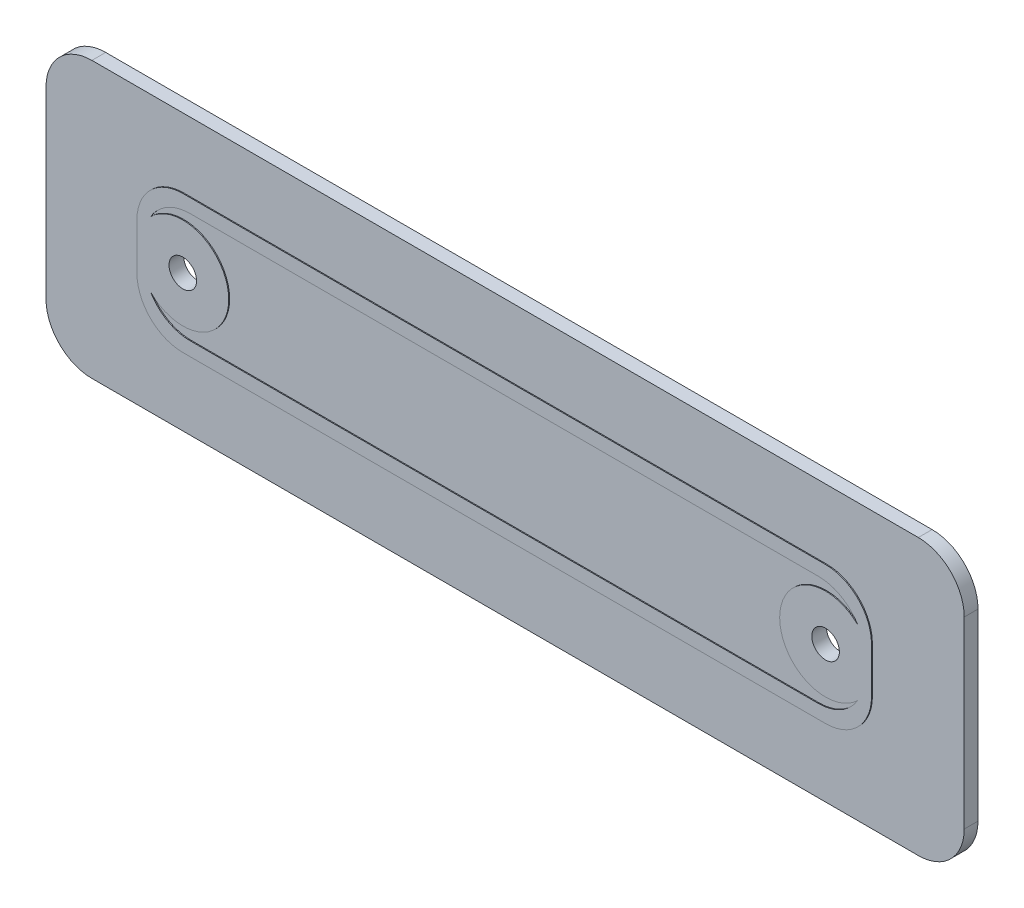
ISO-10303-21;
HEADER;
FILE_DESCRIPTION(('STEP AP214'),'2;1');
FILE_NAME('part.step','',(''),(''),'','','');
FILE_SCHEMA(('AUTOMOTIVE_DESIGN { 1 0 10303 214 1 1 1 1 }'));
ENDSEC;
DATA;
#1=APPLICATION_CONTEXT('core data for automotive mechanical design processes');
#2=APPLICATION_PROTOCOL_DEFINITION('international standard','automotive_design',2000,#1);
#3=PRODUCT_CONTEXT('',#1,'mechanical');
#4=PRODUCT('Part','Part','',(#3));
#5=PRODUCT_RELATED_PRODUCT_CATEGORY('part','',(#4));
#6=PRODUCT_DEFINITION_FORMATION('','',#4);
#7=PRODUCT_DEFINITION_CONTEXT('part definition',#1,'design');
#8=PRODUCT_DEFINITION('design','',#6,#7);
#9=PRODUCT_DEFINITION_SHAPE('','',#8);
#10=(LENGTH_UNIT() NAMED_UNIT(*) SI_UNIT(.MILLI.,.METRE.));
#11=(NAMED_UNIT(*) PLANE_ANGLE_UNIT() SI_UNIT($,.RADIAN.));
#12=(NAMED_UNIT(*) SI_UNIT($,.STERADIAN.) SOLID_ANGLE_UNIT());
#13=UNCERTAINTY_MEASURE_WITH_UNIT(LENGTH_MEASURE(1.E-05),#10,'distance_accuracy_value','');
#14=(GEOMETRIC_REPRESENTATION_CONTEXT(3) GLOBAL_UNCERTAINTY_ASSIGNED_CONTEXT((#13)) GLOBAL_UNIT_ASSIGNED_CONTEXT((#10,
#11,#12)) REPRESENTATION_CONTEXT('',''));
#15=CARTESIAN_POINT('',(0.,0.,0.));
#16=DIRECTION('',(0.,0.,1.));
#17=DIRECTION('',(1.,0.,0.));
#18=AXIS2_PLACEMENT_3D('',#15,#16,#17);
#19=CARTESIAN_POINT('',(0.,0.,1.5));
#20=DIRECTION('',(0.,0.,1.));
#21=DIRECTION('',(1.,0.,0.));
#22=AXIS2_PLACEMENT_3D('',#19,#20,#21);
#23=PLANE('',#22);
#24=DIRECTION('',(-1.,0.,0.));
#25=VECTOR('',#24,1.);
#26=CARTESIAN_POINT('',(-50.,15.,1.5));
#27=LINE('',#26,#25);
#28=CARTESIAN_POINT('',(45.,15.,1.5));
#29=VERTEX_POINT('',#28);
#30=CARTESIAN_POINT('',(-45.,15.,1.5));
#31=VERTEX_POINT('',#30);
#32=EDGE_CURVE('E300',#29,#31,#27,.T.);
#33=ORIENTED_EDGE('',*,*,#32,.T.);
#34=CARTESIAN_POINT('',(-45.,10.,1.5));
#35=DIRECTION('',(0.,0.,1.));
#36=DIRECTION('',(1.,0.,0.));
#37=AXIS2_PLACEMENT_3D('',#34,#35,#36);
#38=CIRCLE('',#37,5.);
#39=CARTESIAN_POINT('',(-50.,10.,1.5));
#40=VERTEX_POINT('',#39);
#41=EDGE_CURVE('E388',#31,#40,#38,.T.);
#42=ORIENTED_EDGE('',*,*,#41,.T.);
#43=DIRECTION('',(0.,-1.,0.));
#44=VECTOR('',#43,1.);
#45=CARTESIAN_POINT('',(-50.,15.,1.5));
#46=LINE('',#45,#44);
#47=CARTESIAN_POINT('',(-50.,-10.,1.5));
#48=VERTEX_POINT('',#47);
#49=EDGE_CURVE('E304',#40,#48,#46,.T.);
#50=ORIENTED_EDGE('',*,*,#49,.T.);
#51=CARTESIAN_POINT('',(-45.,-9.99999999999999,1.5));
#52=DIRECTION('',(0.,0.,1.));
#53=DIRECTION('',(1.,0.,0.));
#54=AXIS2_PLACEMENT_3D('',#51,#52,#53);
#55=CIRCLE('',#54,5.);
#56=CARTESIAN_POINT('',(-45.,-15.,1.5));
#57=VERTEX_POINT('',#56);
#58=EDGE_CURVE('E79',#48,#57,#55,.T.);
#59=ORIENTED_EDGE('',*,*,#58,.T.);
#60=DIRECTION('',(1.,0.,0.));
#61=VECTOR('',#60,1.);
#62=CARTESIAN_POINT('',(-50.,-15.,1.5));
#63=LINE('',#62,#61);
#64=CARTESIAN_POINT('',(45.,-15.,1.5));
#65=VERTEX_POINT('',#64);
#66=EDGE_CURVE('E306',#57,#65,#63,.T.);
#67=ORIENTED_EDGE('',*,*,#66,.T.);
#68=CARTESIAN_POINT('',(45.,-9.99999999999999,1.5));
#69=DIRECTION('',(0.,0.,1.));
#70=DIRECTION('',(1.,0.,0.));
#71=AXIS2_PLACEMENT_3D('',#68,#69,#70);
#72=CIRCLE('',#71,5.);
#73=CARTESIAN_POINT('',(50.,-9.99999999999999,1.5));
#74=VERTEX_POINT('',#73);
#75=EDGE_CURVE('E385',#65,#74,#72,.T.);
#76=ORIENTED_EDGE('',*,*,#75,.T.);
#77=DIRECTION('',(0.,1.,0.));
#78=VECTOR('',#77,1.);
#79=CARTESIAN_POINT('',(50.,15.,1.5));
#80=LINE('',#79,#78);
#81=CARTESIAN_POINT('',(50.,10.,1.5));
#82=VERTEX_POINT('',#81);
#83=EDGE_CURVE('E297',#74,#82,#80,.T.);
#84=ORIENTED_EDGE('',*,*,#83,.T.);
#85=CARTESIAN_POINT('',(45.,10.,1.5));
#86=DIRECTION('',(0.,0.,1.));
#87=DIRECTION('',(1.,0.,0.));
#88=AXIS2_PLACEMENT_3D('',#85,#86,#87);
#89=CIRCLE('',#88,5.);
#90=EDGE_CURVE('E383',#82,#29,#89,.T.);
#91=ORIENTED_EDGE('',*,*,#90,.T.);
#92=EDGE_LOOP('',(#33,#42,#50,#59,#67,#76,#84,#91));
#93=FACE_BOUND('',#92,.T.);
#94=DIRECTION('',(-1.,0.,0.));
#95=VECTOR('',#94,1.);
#96=CARTESIAN_POINT('',(-40.,7.5,1.5));
#97=LINE('',#96,#95);
#98=CARTESIAN_POINT('',(35.,7.5,1.5));
#99=VERTEX_POINT('',#98);
#100=CARTESIAN_POINT('',(-35.,7.5,1.5));
#101=VERTEX_POINT('',#100);
#102=EDGE_CURVE('E289',#99,#101,#97,.T.);
#103=ORIENTED_EDGE('',*,*,#102,.F.);
#104=CARTESIAN_POINT('',(35.,2.5,1.5));
#105=DIRECTION('',(0.,0.,1.));
#106=DIRECTION('',(1.,0.,0.));
#107=AXIS2_PLACEMENT_3D('',#104,#105,#106);
#108=CIRCLE('',#107,5.);
#109=CARTESIAN_POINT('',(40.,2.5,1.5));
#110=VERTEX_POINT('',#109);
#111=EDGE_CURVE('E406',#99,#110,#108,.F.);
#112=ORIENTED_EDGE('',*,*,#111,.T.);
#113=DIRECTION('',(0.,1.,0.));
#114=VECTOR('',#113,1.);
#115=CARTESIAN_POINT('',(40.,7.5,1.5));
#116=LINE('',#115,#114);
#117=CARTESIAN_POINT('',(40.,-2.5,1.5));
#118=VERTEX_POINT('',#117);
#119=EDGE_CURVE('E269',#118,#110,#116,.T.);
#120=ORIENTED_EDGE('',*,*,#119,.F.);
#121=CARTESIAN_POINT('',(35.,-2.5,1.5));
#122=DIRECTION('',(0.,0.,1.));
#123=DIRECTION('',(1.,0.,0.));
#124=AXIS2_PLACEMENT_3D('',#121,#122,#123);
#125=CIRCLE('',#124,5.);
#126=CARTESIAN_POINT('',(35.,-7.5,1.5));
#127=VERTEX_POINT('',#126);
#128=EDGE_CURVE('E408',#118,#127,#125,.F.);
#129=ORIENTED_EDGE('',*,*,#128,.T.);
#130=DIRECTION('',(1.,0.,0.));
#131=VECTOR('',#130,1.);
#132=CARTESIAN_POINT('',(-40.,-7.5,1.5));
#133=LINE('',#132,#131);
#134=CARTESIAN_POINT('',(-35.,-7.5,1.5));
#135=VERTEX_POINT('',#134);
#136=EDGE_CURVE('E277',#135,#127,#133,.T.);
#137=ORIENTED_EDGE('',*,*,#136,.F.);
#138=CARTESIAN_POINT('',(-35.,-2.5,1.5));
#139=DIRECTION('',(0.,0.,1.));
#140=DIRECTION('',(1.,0.,0.));
#141=AXIS2_PLACEMENT_3D('',#138,#139,#140);
#142=CIRCLE('',#141,5.);
#143=CARTESIAN_POINT('',(-40.,-2.5,1.5));
#144=VERTEX_POINT('',#143);
#145=EDGE_CURVE('E12',#135,#144,#142,.F.);
#146=ORIENTED_EDGE('',*,*,#145,.T.);
#147=DIRECTION('',(0.,-1.,0.));
#148=VECTOR('',#147,1.);
#149=CARTESIAN_POINT('',(-40.,7.5,1.5));
#150=LINE('',#149,#148);
#151=CARTESIAN_POINT('',(-40.,2.5,1.5));
#152=VERTEX_POINT('',#151);
#153=EDGE_CURVE('E292',#152,#144,#150,.T.);
#154=ORIENTED_EDGE('',*,*,#153,.F.);
#155=CARTESIAN_POINT('',(-35.,2.5,1.5));
#156=DIRECTION('',(0.,0.,1.));
#157=DIRECTION('',(1.,0.,0.));
#158=AXIS2_PLACEMENT_3D('',#155,#156,#157);
#159=CIRCLE('',#158,5.);
#160=EDGE_CURVE('E65',#152,#101,#159,.F.);
#161=ORIENTED_EDGE('',*,*,#160,.T.);
#162=EDGE_LOOP('',(#103,#112,#120,#129,#137,#146,#154,#161));
#163=FACE_BOUND('',#162,.T.);
#164=ADVANCED_FACE('F57',(#93,#163),#23,.T.);
#165=CARTESIAN_POINT('',(50.,15.,1.5));
#166=DIRECTION('',(-1.,0.,0.));
#167=DIRECTION('',(0.,0.,1.));
#168=AXIS2_PLACEMENT_3D('',#165,#166,#167);
#169=PLANE('',#168);
#170=ORIENTED_EDGE('',*,*,#83,.F.);
#171=DIRECTION('',(0.,0.,-1.));
#172=VECTOR('',#171,1.);
#173=CARTESIAN_POINT('',(50.,-9.99999999999999,1.5));
#174=LINE('',#173,#172);
#175=CARTESIAN_POINT('',(50.,-9.99999999999999,0.));
#176=VERTEX_POINT('',#175);
#177=EDGE_CURVE('E396',#74,#176,#174,.T.);
#178=ORIENTED_EDGE('',*,*,#177,.T.);
#179=DIRECTION('',(0.,1.,0.));
#180=VECTOR('',#179,1.);
#181=CARTESIAN_POINT('',(50.,15.,0.));
#182=LINE('',#181,#180);
#183=CARTESIAN_POINT('',(50.,10.,0.));
#184=VERTEX_POINT('',#183);
#185=EDGE_CURVE('E286',#176,#184,#182,.T.);
#186=ORIENTED_EDGE('',*,*,#185,.T.);
#187=DIRECTION('',(0.,0.,-1.));
#188=VECTOR('',#187,1.);
#189=CARTESIAN_POINT('',(50.,10.,1.5));
#190=LINE('',#189,#188);
#191=EDGE_CURVE('E394',#184,#82,#190,.F.);
#192=ORIENTED_EDGE('',*,*,#191,.T.);
#193=EDGE_LOOP('',(#170,#178,#186,#192));
#194=FACE_BOUND('',#193,.T.);
#195=ADVANCED_FACE('F460',(#194),#169,.F.);
#196=CARTESIAN_POINT('',(-50.,15.,1.5));
#197=DIRECTION('',(0.,-1.,0.));
#198=DIRECTION('',(0.,0.,-1.));
#199=AXIS2_PLACEMENT_3D('',#196,#197,#198);
#200=PLANE('',#199);
#201=DIRECTION('',(-1.,0.,0.));
#202=VECTOR('',#201,1.);
#203=CARTESIAN_POINT('',(-50.,15.,0.));
#204=LINE('',#203,#202);
#205=CARTESIAN_POINT('',(45.,15.,0.));
#206=VERTEX_POINT('',#205);
#207=CARTESIAN_POINT('',(-45.,15.,0.));
#208=VERTEX_POINT('',#207);
#209=EDGE_CURVE('E310',#206,#208,#204,.T.);
#210=ORIENTED_EDGE('',*,*,#209,.T.);
#211=DIRECTION('',(0.,0.,-1.));
#212=VECTOR('',#211,1.);
#213=CARTESIAN_POINT('',(-45.,15.,1.5));
#214=LINE('',#213,#212);
#215=EDGE_CURVE('E381',#208,#31,#214,.F.);
#216=ORIENTED_EDGE('',*,*,#215,.T.);
#217=ORIENTED_EDGE('',*,*,#32,.F.);
#218=DIRECTION('',(0.,0.,-1.));
#219=VECTOR('',#218,1.);
#220=CARTESIAN_POINT('',(45.,15.,1.5));
#221=LINE('',#220,#219);
#222=EDGE_CURVE('E378',#29,#206,#221,.T.);
#223=ORIENTED_EDGE('',*,*,#222,.T.);
#224=EDGE_LOOP('',(#210,#216,#217,#223));
#225=FACE_BOUND('',#224,.T.);
#226=ADVANCED_FACE('F465',(#225),#200,.F.);
#227=CARTESIAN_POINT('',(-50.,15.,1.5));
#228=DIRECTION('',(1.,0.,0.));
#229=DIRECTION('',(0.,1.,0.));
#230=AXIS2_PLACEMENT_3D('',#227,#228,#229);
#231=PLANE('',#230);
#232=ORIENTED_EDGE('',*,*,#49,.F.);
#233=DIRECTION('',(0.,0.,-1.));
#234=VECTOR('',#233,1.);
#235=CARTESIAN_POINT('',(-50.,10.,1.5));
#236=LINE('',#235,#234);
#237=CARTESIAN_POINT('',(-50.,10.,0.));
#238=VERTEX_POINT('',#237);
#239=EDGE_CURVE('E367',#40,#238,#236,.T.);
#240=ORIENTED_EDGE('',*,*,#239,.T.);
#241=DIRECTION('',(0.,-1.,0.));
#242=VECTOR('',#241,1.);
#243=CARTESIAN_POINT('',(-50.,15.,0.));
#244=LINE('',#243,#242);
#245=CARTESIAN_POINT('',(-50.,-10.,0.));
#246=VERTEX_POINT('',#245);
#247=EDGE_CURVE('E313',#238,#246,#244,.T.);
#248=ORIENTED_EDGE('',*,*,#247,.T.);
#249=DIRECTION('',(0.,0.,-1.));
#250=VECTOR('',#249,1.);
#251=CARTESIAN_POINT('',(-50.,-10.,1.5));
#252=LINE('',#251,#250);
#253=EDGE_CURVE('E365',#246,#48,#252,.F.);
#254=ORIENTED_EDGE('',*,*,#253,.T.);
#255=EDGE_LOOP('',(#232,#240,#248,#254));
#256=FACE_BOUND('',#255,.T.);
#257=ADVANCED_FACE('F663',(#256),#231,.F.);
#258=CARTESIAN_POINT('',(-50.,-15.,1.5));
#259=DIRECTION('',(0.,1.,0.));
#260=DIRECTION('',(0.,0.,1.));
#261=AXIS2_PLACEMENT_3D('',#258,#259,#260);
#262=PLANE('',#261);
#263=ORIENTED_EDGE('',*,*,#66,.F.);
#264=DIRECTION('',(0.,0.,-1.));
#265=VECTOR('',#264,1.);
#266=CARTESIAN_POINT('',(-45.,-15.,1.5));
#267=LINE('',#266,#265);
#268=CARTESIAN_POINT('',(-45.,-15.,0.));
#269=VERTEX_POINT('',#268);
#270=EDGE_CURVE('E391',#57,#269,#267,.T.);
#271=ORIENTED_EDGE('',*,*,#270,.T.);
#272=DIRECTION('',(1.,0.,0.));
#273=VECTOR('',#272,1.);
#274=CARTESIAN_POINT('',(-50.,-15.,0.));
#275=LINE('',#274,#273);
#276=CARTESIAN_POINT('',(45.,-15.,0.));
#277=VERTEX_POINT('',#276);
#278=EDGE_CURVE('E301',#269,#277,#275,.T.);
#279=ORIENTED_EDGE('',*,*,#278,.T.);
#280=DIRECTION('',(0.,0.,-1.));
#281=VECTOR('',#280,1.);
#282=CARTESIAN_POINT('',(45.,-15.,1.5));
#283=LINE('',#282,#281);
#284=EDGE_CURVE('E72',#277,#65,#283,.F.);
#285=ORIENTED_EDGE('',*,*,#284,.T.);
#286=EDGE_LOOP('',(#263,#271,#279,#285));
#287=FACE_BOUND('',#286,.T.);
#288=ADVANCED_FACE('F668',(#287),#262,.F.);
#289=CARTESIAN_POINT('',(0.,0.,0.));
#290=DIRECTION('',(0.,0.,1.));
#291=DIRECTION('',(1.,0.,0.));
#292=AXIS2_PLACEMENT_3D('',#289,#290,#291);
#293=PLANE('',#292);
#294=CARTESIAN_POINT('',(-35.,0.,0.));
#295=DIRECTION('',(0.,0.,1.));
#296=DIRECTION('',(1.,0.,0.));
#297=AXIS2_PLACEMENT_3D('',#294,#295,#296);
#298=CIRCLE('',#297,1.5);
#299=CARTESIAN_POINT('',(-33.5,0.,0.));
#300=VERTEX_POINT('',#299);
#301=EDGE_CURVE('E322',#300,#300,#298,.T.);
#302=ORIENTED_EDGE('',*,*,#301,.T.);
#303=EDGE_LOOP('',(#302));
#304=FACE_BOUND('',#303,.T.);
#305=CARTESIAN_POINT('',(35.,0.,0.));
#306=DIRECTION('',(0.,0.,1.));
#307=DIRECTION('',(-1.,0.,0.));
#308=AXIS2_PLACEMENT_3D('',#305,#306,#307);
#309=CIRCLE('',#308,1.5);
#310=CARTESIAN_POINT('',(33.5,0.,0.));
#311=VERTEX_POINT('',#310);
#312=EDGE_CURVE('E748',#311,#311,#309,.T.);
#313=ORIENTED_EDGE('',*,*,#312,.T.);
#314=EDGE_LOOP('',(#313));
#315=FACE_BOUND('',#314,.T.);
#316=ORIENTED_EDGE('',*,*,#247,.F.);
#317=CARTESIAN_POINT('',(-45.,10.,0.));
#318=DIRECTION('',(0.,0.,1.));
#319=DIRECTION('',(1.,0.,0.));
#320=AXIS2_PLACEMENT_3D('',#317,#318,#319);
#321=CIRCLE('',#320,5.);
#322=EDGE_CURVE('E376',#238,#208,#321,.F.);
#323=ORIENTED_EDGE('',*,*,#322,.T.);
#324=ORIENTED_EDGE('',*,*,#209,.F.);
#325=CARTESIAN_POINT('',(45.,10.,0.));
#326=DIRECTION('',(0.,0.,1.));
#327=DIRECTION('',(1.,0.,0.));
#328=AXIS2_PLACEMENT_3D('',#325,#326,#327);
#329=CIRCLE('',#328,5.);
#330=EDGE_CURVE('E370',#206,#184,#329,.F.);
#331=ORIENTED_EDGE('',*,*,#330,.T.);
#332=ORIENTED_EDGE('',*,*,#185,.F.);
#333=CARTESIAN_POINT('',(45.,-9.99999999999999,0.));
#334=DIRECTION('',(0.,0.,1.));
#335=DIRECTION('',(1.,0.,0.));
#336=AXIS2_PLACEMENT_3D('',#333,#334,#335);
#337=CIRCLE('',#336,5.);
#338=EDGE_CURVE('E372',#176,#277,#337,.F.);
#339=ORIENTED_EDGE('',*,*,#338,.T.);
#340=ORIENTED_EDGE('',*,*,#278,.F.);
#341=CARTESIAN_POINT('',(-45.,-9.99999999999999,0.));
#342=DIRECTION('',(0.,0.,1.));
#343=DIRECTION('',(1.,0.,0.));
#344=AXIS2_PLACEMENT_3D('',#341,#342,#343);
#345=CIRCLE('',#344,5.);
#346=EDGE_CURVE('E374',#269,#246,#345,.F.);
#347=ORIENTED_EDGE('',*,*,#346,.T.);
#348=EDGE_LOOP('',(#316,#323,#324,#331,#332,#339,#340,#347));
#349=FACE_BOUND('',#348,.T.);
#350=ADVANCED_FACE('F491',(#304,#315,#349),#293,.F.);
#351=CARTESIAN_POINT('',(0.,0.,1.6));
#352=DIRECTION('',(0.,0.,1.));
#353=DIRECTION('',(1.,0.,0.));
#354=AXIS2_PLACEMENT_3D('',#351,#352,#353);
#355=PLANE('',#354);
#356=CARTESIAN_POINT('',(-35.,0.,1.6));
#357=DIRECTION('',(0.,0.,1.));
#358=DIRECTION('',(1.,0.,0.));
#359=AXIS2_PLACEMENT_3D('',#356,#357,#358);
#360=CIRCLE('',#359,1.5);
#361=CARTESIAN_POINT('',(-33.5,0.,1.6));
#362=VERTEX_POINT('',#361);
#363=EDGE_CURVE('E250',#362,#362,#360,.T.);
#364=ORIENTED_EDGE('',*,*,#363,.F.);
#365=EDGE_LOOP('',(#364));
#366=FACE_BOUND('',#365,.T.);
#367=CARTESIAN_POINT('',(35.,0.,1.6));
#368=DIRECTION('',(0.,0.,1.));
#369=DIRECTION('',(1.,0.,0.));
#370=AXIS2_PLACEMENT_3D('',#367,#368,#369);
#371=CIRCLE('',#370,1.5);
#372=CARTESIAN_POINT('',(36.5,0.,1.6));
#373=VERTEX_POINT('',#372);
#374=EDGE_CURVE('E319',#373,#373,#371,.T.);
#375=ORIENTED_EDGE('',*,*,#374,.F.);
#376=EDGE_LOOP('',(#375));
#377=FACE_BOUND('',#376,.T.);
#378=CARTESIAN_POINT('',(35.,0.,1.6));
#379=DIRECTION('',(0.,0.,1.));
#380=DIRECTION('',(1.,0.,0.));
#381=AXIS2_PLACEMENT_3D('',#378,#379,#380);
#382=CIRCLE('',#381,5.);
#383=CARTESIAN_POINT('',(38.5,3.57071421427144,1.6));
#384=VERTEX_POINT('',#383);
#385=CARTESIAN_POINT('',(38.5,-3.57071421427144,1.6));
#386=VERTEX_POINT('',#385);
#387=EDGE_CURVE('E246',#384,#386,#382,.T.);
#388=ORIENTED_EDGE('',*,*,#387,.T.);
#389=CARTESIAN_POINT('',(34.2114771274315,-0.999999999999998,1.6));
#390=DIRECTION('',(0.,0.,1.));
#391=DIRECTION('',(1.,0.,0.));
#392=AXIS2_PLACEMENT_3D('',#389,#390,#391);
#393=CIRCLE('',#392,5.);
#394=CARTESIAN_POINT('',(34.2114771274315,-6.,1.6));
#395=VERTEX_POINT('',#394);
#396=EDGE_CURVE('E245',#386,#395,#393,.F.);
#397=ORIENTED_EDGE('',*,*,#396,.T.);
#398=DIRECTION('',(1.,0.,0.));
#399=VECTOR('',#398,1.);
#400=CARTESIAN_POINT('',(-40.,-6.,1.6));
#401=LINE('',#400,#399);
#402=CARTESIAN_POINT('',(-34.2114771274315,-6.,1.6));
#403=VERTEX_POINT('',#402);
#404=EDGE_CURVE('E266',#403,#395,#401,.T.);
#405=ORIENTED_EDGE('',*,*,#404,.F.);
#406=CARTESIAN_POINT('',(-34.2114771274315,-0.999999999999998,1.6));
#407=DIRECTION('',(0.,0.,1.));
#408=DIRECTION('',(1.,0.,0.));
#409=AXIS2_PLACEMENT_3D('',#406,#407,#408);
#410=CIRCLE('',#409,5.);
#411=CARTESIAN_POINT('',(-38.5,-3.57071421427142,1.6));
#412=VERTEX_POINT('',#411);
#413=EDGE_CURVE('E402',#403,#412,#410,.F.);
#414=ORIENTED_EDGE('',*,*,#413,.T.);
#415=CARTESIAN_POINT('',(-35.,0.,1.6));
#416=DIRECTION('',(0.,0.,1.));
#417=DIRECTION('',(1.,0.,0.));
#418=AXIS2_PLACEMENT_3D('',#415,#416,#417);
#419=CIRCLE('',#418,5.);
#420=CARTESIAN_POINT('',(-38.5,3.57071421427142,1.6));
#421=VERTEX_POINT('',#420);
#422=EDGE_CURVE('E248',#412,#421,#419,.T.);
#423=ORIENTED_EDGE('',*,*,#422,.T.);
#424=CARTESIAN_POINT('',(-34.2114771274315,1.,1.6));
#425=DIRECTION('',(0.,0.,1.));
#426=DIRECTION('',(1.,0.,0.));
#427=AXIS2_PLACEMENT_3D('',#424,#425,#426);
#428=CIRCLE('',#427,5.);
#429=CARTESIAN_POINT('',(-34.2114771274315,6.,1.6));
#430=VERTEX_POINT('',#429);
#431=EDGE_CURVE('E404',#421,#430,#428,.F.);
#432=ORIENTED_EDGE('',*,*,#431,.T.);
#433=DIRECTION('',(-1.,0.,0.));
#434=VECTOR('',#433,1.);
#435=CARTESIAN_POINT('',(-40.,6.,1.6));
#436=LINE('',#435,#434);
#437=CARTESIAN_POINT('',(34.2114771274315,6.,1.6));
#438=VERTEX_POINT('',#437);
#439=EDGE_CURVE('E263',#438,#430,#436,.T.);
#440=ORIENTED_EDGE('',*,*,#439,.F.);
#441=CARTESIAN_POINT('',(34.2114771274315,1.,1.6));
#442=DIRECTION('',(0.,0.,1.));
#443=DIRECTION('',(1.,0.,0.));
#444=AXIS2_PLACEMENT_3D('',#441,#442,#443);
#445=CIRCLE('',#444,5.);
#446=EDGE_CURVE('E400',#438,#384,#445,.F.);
#447=ORIENTED_EDGE('',*,*,#446,.T.);
#448=EDGE_LOOP('',(#388,#397,#405,#414,#423,#432,#440,#447));
#449=FACE_BOUND('',#448,.T.);
#450=DIRECTION('',(0.,1.,0.));
#451=VECTOR('',#450,1.);
#452=CARTESIAN_POINT('',(40.,7.5,1.6));
#453=LINE('',#452,#451);
#454=CARTESIAN_POINT('',(40.,-2.5,1.6));
#455=VERTEX_POINT('',#454);
#456=CARTESIAN_POINT('',(40.,2.5,1.6));
#457=VERTEX_POINT('',#456);
#458=EDGE_CURVE('E273',#455,#457,#453,.T.);
#459=ORIENTED_EDGE('',*,*,#458,.T.);
#460=CARTESIAN_POINT('',(35.,2.5,1.6));
#461=DIRECTION('',(0.,0.,1.));
#462=DIRECTION('',(1.,0.,0.));
#463=AXIS2_PLACEMENT_3D('',#460,#461,#462);
#464=CIRCLE('',#463,5.);
#465=CARTESIAN_POINT('',(35.,7.5,1.6));
#466=VERTEX_POINT('',#465);
#467=EDGE_CURVE('E353',#457,#466,#464,.T.);
#468=ORIENTED_EDGE('',*,*,#467,.T.);
#469=DIRECTION('',(-1.,0.,0.));
#470=VECTOR('',#469,1.);
#471=CARTESIAN_POINT('',(-40.,7.5,1.6));
#472=LINE('',#471,#470);
#473=CARTESIAN_POINT('',(-35.,7.5,1.6));
#474=VERTEX_POINT('',#473);
#475=EDGE_CURVE('E276',#466,#474,#472,.T.);
#476=ORIENTED_EDGE('',*,*,#475,.T.);
#477=CARTESIAN_POINT('',(-35.,2.5,1.6));
#478=DIRECTION('',(0.,0.,1.));
#479=DIRECTION('',(1.,0.,0.));
#480=AXIS2_PLACEMENT_3D('',#477,#478,#479);
#481=CIRCLE('',#480,5.);
#482=CARTESIAN_POINT('',(-40.,2.5,1.6));
#483=VERTEX_POINT('',#482);
#484=EDGE_CURVE('E349',#474,#483,#481,.T.);
#485=ORIENTED_EDGE('',*,*,#484,.T.);
#486=DIRECTION('',(0.,-1.,0.));
#487=VECTOR('',#486,1.);
#488=CARTESIAN_POINT('',(-40.,7.5,1.6));
#489=LINE('',#488,#487);
#490=CARTESIAN_POINT('',(-40.,-2.5,1.6));
#491=VERTEX_POINT('',#490);
#492=EDGE_CURVE('E280',#483,#491,#489,.T.);
#493=ORIENTED_EDGE('',*,*,#492,.T.);
#494=CARTESIAN_POINT('',(-35.,-2.5,1.6));
#495=DIRECTION('',(0.,0.,1.));
#496=DIRECTION('',(1.,0.,0.));
#497=AXIS2_PLACEMENT_3D('',#494,#495,#496);
#498=CIRCLE('',#497,5.);
#499=CARTESIAN_POINT('',(-35.,-7.5,1.6));
#500=VERTEX_POINT('',#499);
#501=EDGE_CURVE('E347',#491,#500,#498,.T.);
#502=ORIENTED_EDGE('',*,*,#501,.T.);
#503=DIRECTION('',(1.,0.,0.));
#504=VECTOR('',#503,1.);
#505=CARTESIAN_POINT('',(-40.,-7.5,1.6));
#506=LINE('',#505,#504);
#507=CARTESIAN_POINT('',(35.,-7.5,1.6));
#508=VERTEX_POINT('',#507);
#509=EDGE_CURVE('E283',#500,#508,#506,.T.);
#510=ORIENTED_EDGE('',*,*,#509,.T.);
#511=CARTESIAN_POINT('',(35.,-2.5,1.6));
#512=DIRECTION('',(0.,0.,1.));
#513=DIRECTION('',(1.,0.,0.));
#514=AXIS2_PLACEMENT_3D('',#511,#512,#513);
#515=CIRCLE('',#514,5.);
#516=EDGE_CURVE('E351',#508,#455,#515,.T.);
#517=ORIENTED_EDGE('',*,*,#516,.T.);
#518=EDGE_LOOP('',(#459,#468,#476,#485,#493,#502,#510,#517));
#519=FACE_BOUND('',#518,.T.);
#520=ADVANCED_FACE('F423',(#366,#377,#449,#519),#355,.T.);
#521=CARTESIAN_POINT('',(40.,7.5,1.6));
#522=DIRECTION('',(-1.,0.,0.));
#523=DIRECTION('',(0.,0.,1.));
#524=AXIS2_PLACEMENT_3D('',#521,#522,#523);
#525=PLANE('',#524);
#526=ORIENTED_EDGE('',*,*,#119,.T.);
#527=DIRECTION('',(0.,0.,-1.));
#528=VECTOR('',#527,1.);
#529=CARTESIAN_POINT('',(40.,2.5,1.6));
#530=LINE('',#529,#528);
#531=EDGE_CURVE('E345',#110,#457,#530,.F.);
#532=ORIENTED_EDGE('',*,*,#531,.T.);
#533=ORIENTED_EDGE('',*,*,#458,.F.);
#534=DIRECTION('',(0.,0.,-1.));
#535=VECTOR('',#534,1.);
#536=CARTESIAN_POINT('',(40.,-2.5,1.6));
#537=LINE('',#536,#535);
#538=EDGE_CURVE('E342',#455,#118,#537,.T.);
#539=ORIENTED_EDGE('',*,*,#538,.T.);
#540=EDGE_LOOP('',(#526,#532,#533,#539));
#541=FACE_BOUND('',#540,.T.);
#542=ADVANCED_FACE('F443',(#541),#525,.F.);
#543=CARTESIAN_POINT('',(-40.,7.5,1.6));
#544=DIRECTION('',(0.,-1.,0.));
#545=DIRECTION('',(0.,0.,-1.));
#546=AXIS2_PLACEMENT_3D('',#543,#544,#545);
#547=PLANE('',#546);
#548=ORIENTED_EDGE('',*,*,#475,.F.);
#549=DIRECTION('',(0.,0.,-1.));
#550=VECTOR('',#549,1.);
#551=CARTESIAN_POINT('',(35.,7.5,1.6));
#552=LINE('',#551,#550);
#553=EDGE_CURVE('E339',#466,#99,#552,.T.);
#554=ORIENTED_EDGE('',*,*,#553,.T.);
#555=ORIENTED_EDGE('',*,*,#102,.T.);
#556=DIRECTION('',(0.,0.,-1.));
#557=VECTOR('',#556,1.);
#558=CARTESIAN_POINT('',(-35.,7.5,1.6));
#559=LINE('',#558,#557);
#560=EDGE_CURVE('E337',#101,#474,#559,.F.);
#561=ORIENTED_EDGE('',*,*,#560,.T.);
#562=EDGE_LOOP('',(#548,#554,#555,#561));
#563=FACE_BOUND('',#562,.T.);
#564=ADVANCED_FACE('F417',(#563),#547,.F.);
#565=CARTESIAN_POINT('',(-40.,7.5,1.6));
#566=DIRECTION('',(1.,0.,0.));
#567=DIRECTION('',(0.,0.,-1.));
#568=AXIS2_PLACEMENT_3D('',#565,#566,#567);
#569=PLANE('',#568);
#570=ORIENTED_EDGE('',*,*,#492,.F.);
#571=DIRECTION('',(0.,0.,-1.));
#572=VECTOR('',#571,1.);
#573=CARTESIAN_POINT('',(-40.,2.5,1.6));
#574=LINE('',#573,#572);
#575=EDGE_CURVE('E362',#483,#152,#574,.T.);
#576=ORIENTED_EDGE('',*,*,#575,.T.);
#577=ORIENTED_EDGE('',*,*,#153,.T.);
#578=DIRECTION('',(0.,0.,-1.));
#579=VECTOR('',#578,1.);
#580=CARTESIAN_POINT('',(-40.,-2.5,1.6));
#581=LINE('',#580,#579);
#582=EDGE_CURVE('E360',#144,#491,#581,.F.);
#583=ORIENTED_EDGE('',*,*,#582,.T.);
#584=EDGE_LOOP('',(#570,#576,#577,#583));
#585=FACE_BOUND('',#584,.T.);
#586=ADVANCED_FACE('F426',(#585),#569,.F.);
#587=CARTESIAN_POINT('',(-40.,-7.5,1.6));
#588=DIRECTION('',(0.,1.,0.));
#589=DIRECTION('',(0.,0.,1.));
#590=AXIS2_PLACEMENT_3D('',#587,#588,#589);
#591=PLANE('',#590);
#592=ORIENTED_EDGE('',*,*,#136,.T.);
#593=DIRECTION('',(0.,0.,-1.));
#594=VECTOR('',#593,1.);
#595=CARTESIAN_POINT('',(35.,-7.5,1.6));
#596=LINE('',#595,#594);
#597=EDGE_CURVE('E358',#127,#508,#596,.F.);
#598=ORIENTED_EDGE('',*,*,#597,.T.);
#599=ORIENTED_EDGE('',*,*,#509,.F.);
#600=DIRECTION('',(0.,0.,-1.));
#601=VECTOR('',#600,1.);
#602=CARTESIAN_POINT('',(-35.,-7.5,1.6));
#603=LINE('',#602,#601);
#604=EDGE_CURVE('E355',#500,#135,#603,.T.);
#605=ORIENTED_EDGE('',*,*,#604,.T.);
#606=EDGE_LOOP('',(#592,#598,#599,#605));
#607=FACE_BOUND('',#606,.T.);
#608=ADVANCED_FACE('F434',(#607),#591,.F.);
#609=CARTESIAN_POINT('',(-40.,6.,1.6));
#610=DIRECTION('',(0.,-1.,0.));
#611=DIRECTION('',(0.,0.,-1.));
#612=AXIS2_PLACEMENT_3D('',#609,#610,#611);
#613=PLANE('',#612);
#614=DIRECTION('',(-1.,0.,0.));
#615=VECTOR('',#614,1.);
#616=CARTESIAN_POINT('',(-40.,6.,1.5));
#617=LINE('',#616,#615);
#618=CARTESIAN_POINT('',(34.2114771274315,6.,1.5));
#619=VERTEX_POINT('',#618);
#620=CARTESIAN_POINT('',(-34.2114771274315,6.,1.5));
#621=VERTEX_POINT('',#620);
#622=EDGE_CURVE('E262',#619,#621,#617,.T.);
#623=ORIENTED_EDGE('',*,*,#622,.F.);
#624=DIRECTION('',(0.,0.,1.));
#625=VECTOR('',#624,1.);
#626=CARTESIAN_POINT('',(34.2114771274315,6.,1.6));
#627=LINE('',#626,#625);
#628=EDGE_CURVE('E335',#619,#438,#627,.T.);
#629=ORIENTED_EDGE('',*,*,#628,.T.);
#630=ORIENTED_EDGE('',*,*,#439,.T.);
#631=DIRECTION('',(0.,0.,1.));
#632=VECTOR('',#631,1.);
#633=CARTESIAN_POINT('',(-34.2114771274315,6.,1.5));
#634=LINE('',#633,#632);
#635=EDGE_CURVE('E229',#430,#621,#634,.F.);
#636=ORIENTED_EDGE('',*,*,#635,.T.);
#637=EDGE_LOOP('',(#623,#629,#630,#636));
#638=FACE_BOUND('',#637,.T.);
#639=ADVANCED_FACE('F479',(#638),#613,.T.);
#640=CARTESIAN_POINT('',(-40.,-6.,1.6));
#641=DIRECTION('',(0.,1.,0.));
#642=DIRECTION('',(0.,0.,1.));
#643=AXIS2_PLACEMENT_3D('',#640,#641,#642);
#644=PLANE('',#643);
#645=ORIENTED_EDGE('',*,*,#404,.T.);
#646=DIRECTION('',(0.,0.,1.));
#647=VECTOR('',#646,1.);
#648=CARTESIAN_POINT('',(34.2114771274315,-6.,1.5));
#649=LINE('',#648,#647);
#650=CARTESIAN_POINT('',(34.2114771274315,-6.,1.5));
#651=VERTEX_POINT('',#650);
#652=EDGE_CURVE('E326',#395,#651,#649,.F.);
#653=ORIENTED_EDGE('',*,*,#652,.T.);
#654=DIRECTION('',(1.,0.,0.));
#655=VECTOR('',#654,1.);
#656=CARTESIAN_POINT('',(-40.,-6.,1.5));
#657=LINE('',#656,#655);
#658=CARTESIAN_POINT('',(-34.2114771274315,-6.,1.5));
#659=VERTEX_POINT('',#658);
#660=EDGE_CURVE('E224',#659,#651,#657,.T.);
#661=ORIENTED_EDGE('',*,*,#660,.F.);
#662=DIRECTION('',(0.,0.,1.));
#663=VECTOR('',#662,1.);
#664=CARTESIAN_POINT('',(-34.2114771274315,-6.,1.6));
#665=LINE('',#664,#663);
#666=EDGE_CURVE('E240',#659,#403,#665,.T.);
#667=ORIENTED_EDGE('',*,*,#666,.T.);
#668=EDGE_LOOP('',(#645,#653,#661,#667));
#669=FACE_BOUND('',#668,.T.);
#670=ADVANCED_FACE('F472',(#669),#644,.T.);
#671=ORIENTED_EDGE('',*,*,#660,.T.);
#672=CARTESIAN_POINT('',(34.2114771274315,-0.999999999999998,1.5));
#673=DIRECTION('',(0.,0.,1.));
#674=DIRECTION('',(1.,0.,0.));
#675=AXIS2_PLACEMENT_3D('',#672,#673,#674);
#676=CIRCLE('',#675,5.);
#677=CARTESIAN_POINT('',(38.5,-3.57071421427144,1.5));
#678=VERTEX_POINT('',#677);
#679=EDGE_CURVE('E219',#651,#678,#676,.T.);
#680=ORIENTED_EDGE('',*,*,#679,.T.);
#681=CARTESIAN_POINT('',(35.,0.,1.5));
#682=DIRECTION('',(0.,0.,1.));
#683=DIRECTION('',(1.,0.,0.));
#684=AXIS2_PLACEMENT_3D('',#681,#682,#683);
#685=CIRCLE('',#684,5.);
#686=CARTESIAN_POINT('',(38.5,3.57071421427144,1.5));
#687=VERTEX_POINT('',#686);
#688=EDGE_CURVE('E222',#678,#687,#685,.F.);
#689=ORIENTED_EDGE('',*,*,#688,.T.);
#690=CARTESIAN_POINT('',(34.2114771274315,1.,1.5));
#691=DIRECTION('',(0.,0.,1.));
#692=DIRECTION('',(1.,0.,0.));
#693=AXIS2_PLACEMENT_3D('',#690,#691,#692);
#694=CIRCLE('',#693,5.);
#695=EDGE_CURVE('E230',#687,#619,#694,.T.);
#696=ORIENTED_EDGE('',*,*,#695,.T.);
#697=ORIENTED_EDGE('',*,*,#622,.T.);
#698=CARTESIAN_POINT('',(-34.2114771274315,1.,1.5));
#699=DIRECTION('',(0.,0.,1.));
#700=DIRECTION('',(1.,0.,0.));
#701=AXIS2_PLACEMENT_3D('',#698,#699,#700);
#702=CIRCLE('',#701,5.);
#703=CARTESIAN_POINT('',(-38.5,3.57071421427142,1.5));
#704=VERTEX_POINT('',#703);
#705=EDGE_CURVE('E328',#621,#704,#702,.T.);
#706=ORIENTED_EDGE('',*,*,#705,.T.);
#707=CARTESIAN_POINT('',(-35.,0.,1.5));
#708=DIRECTION('',(0.,0.,1.));
#709=DIRECTION('',(1.,0.,0.));
#710=AXIS2_PLACEMENT_3D('',#707,#708,#709);
#711=CIRCLE('',#710,5.);
#712=CARTESIAN_POINT('',(-38.5,-3.57071421427142,1.5));
#713=VERTEX_POINT('',#712);
#714=EDGE_CURVE('E241',#704,#713,#711,.F.);
#715=ORIENTED_EDGE('',*,*,#714,.T.);
#716=CARTESIAN_POINT('',(-34.2114771274315,-0.999999999999998,1.5));
#717=DIRECTION('',(0.,0.,1.));
#718=DIRECTION('',(1.,0.,0.));
#719=AXIS2_PLACEMENT_3D('',#716,#717,#718);
#720=CIRCLE('',#719,5.);
#721=EDGE_CURVE('E330',#713,#659,#720,.T.);
#722=ORIENTED_EDGE('',*,*,#721,.T.);
#723=EDGE_LOOP('',(#671,#680,#689,#696,#697,#706,#715,#722));
#724=FACE_BOUND('',#723,.T.);
#725=ADVANCED_FACE('F221',(#724),#23,.T.);
#726=CARTESIAN_POINT('',(-35.,0.,15.742135623731));
#727=DIRECTION('',(0.,0.,-1.));
#728=DIRECTION('',(-1.,0.,0.));
#729=AXIS2_PLACEMENT_3D('',#726,#727,#728);
#730=CYLINDRICAL_SURFACE('',#729,5.);
#731=DIRECTION('',(0.,0.,-1.));
#732=VECTOR('',#731,1.);
#733=CARTESIAN_POINT('',(-38.5,-3.57071421427142,15.742135623731));
#734=LINE('',#733,#732);
#735=EDGE_CURVE('E259',#713,#412,#734,.F.);
#736=ORIENTED_EDGE('',*,*,#735,.F.);
#737=ORIENTED_EDGE('',*,*,#714,.F.);
#738=DIRECTION('',(0.,0.,-1.));
#739=VECTOR('',#738,1.);
#740=CARTESIAN_POINT('',(-38.5,3.57071421427142,15.742135623731));
#741=LINE('',#740,#739);
#742=EDGE_CURVE('E256',#421,#704,#741,.T.);
#743=ORIENTED_EDGE('',*,*,#742,.F.);
#744=ORIENTED_EDGE('',*,*,#422,.F.);
#745=EDGE_LOOP('',(#736,#737,#743,#744));
#746=FACE_BOUND('',#745,.T.);
#747=ADVANCED_FACE('F471',(#746),#730,.T.);
#748=CARTESIAN_POINT('',(35.,0.,15.742135623731));
#749=DIRECTION('',(0.,0.,-1.));
#750=DIRECTION('',(-1.,0.,0.));
#751=AXIS2_PLACEMENT_3D('',#748,#749,#750);
#752=CYLINDRICAL_SURFACE('',#751,5.);
#753=DIRECTION('',(0.,0.,-1.));
#754=VECTOR('',#753,1.);
#755=CARTESIAN_POINT('',(38.5,3.57071421427144,15.742135623731));
#756=LINE('',#755,#754);
#757=EDGE_CURVE('E239',#687,#384,#756,.F.);
#758=ORIENTED_EDGE('',*,*,#757,.F.);
#759=ORIENTED_EDGE('',*,*,#688,.F.);
#760=DIRECTION('',(0.,0.,-1.));
#761=VECTOR('',#760,1.);
#762=CARTESIAN_POINT('',(38.5,-3.57071421427144,15.742135623731));
#763=LINE('',#762,#761);
#764=EDGE_CURVE('E236',#386,#678,#763,.T.);
#765=ORIENTED_EDGE('',*,*,#764,.F.);
#766=ORIENTED_EDGE('',*,*,#387,.F.);
#767=EDGE_LOOP('',(#758,#759,#765,#766));
#768=FACE_BOUND('',#767,.T.);
#769=ADVANCED_FACE('F234',(#768),#752,.T.);
#770=CARTESIAN_POINT('',(35.,0.,0.));
#771=DIRECTION('',(0.,0.,1.));
#772=DIRECTION('',(1.,0.,0.));
#773=AXIS2_PLACEMENT_3D('',#770,#771,#772);
#774=CYLINDRICAL_SURFACE('',#773,1.5);
#775=ORIENTED_EDGE('',*,*,#374,.T.);
#776=EDGE_LOOP('',(#775));
#777=FACE_BOUND('',#776,.T.);
#778=ORIENTED_EDGE('',*,*,#312,.F.);
#779=EDGE_LOOP('',(#778));
#780=FACE_BOUND('',#779,.T.);
#781=ADVANCED_FACE('F547',(#777,#780),#774,.F.);
#782=CARTESIAN_POINT('',(-35.,0.,0.));
#783=DIRECTION('',(0.,0.,1.));
#784=DIRECTION('',(1.,0.,0.));
#785=AXIS2_PLACEMENT_3D('',#782,#783,#784);
#786=CYLINDRICAL_SURFACE('',#785,1.5);
#787=ORIENTED_EDGE('',*,*,#363,.T.);
#788=EDGE_LOOP('',(#787));
#789=FACE_BOUND('',#788,.T.);
#790=ORIENTED_EDGE('',*,*,#301,.F.);
#791=EDGE_LOOP('',(#790));
#792=FACE_BOUND('',#791,.T.);
#793=ADVANCED_FACE('F558',(#789,#792),#786,.F.);
#794=CARTESIAN_POINT('',(34.2114771274315,-0.999999999999998,15.742135623731));
#795=DIRECTION('',(0.,0.,-1.));
#796=DIRECTION('',(-1.,0.,0.));
#797=AXIS2_PLACEMENT_3D('',#794,#795,#796);
#798=CYLINDRICAL_SURFACE('',#797,5.);
#799=ORIENTED_EDGE('',*,*,#396,.F.);
#800=ORIENTED_EDGE('',*,*,#764,.T.);
#801=ORIENTED_EDGE('',*,*,#679,.F.);
#802=ORIENTED_EDGE('',*,*,#652,.F.);
#803=EDGE_LOOP('',(#799,#800,#801,#802));
#804=FACE_BOUND('',#803,.T.);
#805=ADVANCED_FACE('F244',(#804),#798,.F.);
#806=CARTESIAN_POINT('',(34.2114771274315,1.,15.742135623731));
#807=DIRECTION('',(0.,0.,-1.));
#808=DIRECTION('',(-1.,0.,0.));
#809=AXIS2_PLACEMENT_3D('',#806,#807,#808);
#810=CYLINDRICAL_SURFACE('',#809,5.);
#811=ORIENTED_EDGE('',*,*,#446,.F.);
#812=ORIENTED_EDGE('',*,*,#628,.F.);
#813=ORIENTED_EDGE('',*,*,#695,.F.);
#814=ORIENTED_EDGE('',*,*,#757,.T.);
#815=EDGE_LOOP('',(#811,#812,#813,#814));
#816=FACE_BOUND('',#815,.T.);
#817=ADVANCED_FACE('F557',(#816),#810,.F.);
#818=CARTESIAN_POINT('',(-34.2114771274315,-0.999999999999998,15.742135623731));
#819=DIRECTION('',(0.,0.,-1.));
#820=DIRECTION('',(-1.,0.,0.));
#821=AXIS2_PLACEMENT_3D('',#818,#819,#820);
#822=CYLINDRICAL_SURFACE('',#821,5.);
#823=ORIENTED_EDGE('',*,*,#413,.F.);
#824=ORIENTED_EDGE('',*,*,#666,.F.);
#825=ORIENTED_EDGE('',*,*,#721,.F.);
#826=ORIENTED_EDGE('',*,*,#735,.T.);
#827=EDGE_LOOP('',(#823,#824,#825,#826));
#828=FACE_BOUND('',#827,.T.);
#829=ADVANCED_FACE('F456',(#828),#822,.F.);
#830=CARTESIAN_POINT('',(-34.2114771274315,1.,15.742135623731));
#831=DIRECTION('',(0.,0.,-1.));
#832=DIRECTION('',(-1.,0.,0.));
#833=AXIS2_PLACEMENT_3D('',#830,#831,#832);
#834=CYLINDRICAL_SURFACE('',#833,5.);
#835=ORIENTED_EDGE('',*,*,#431,.F.);
#836=ORIENTED_EDGE('',*,*,#742,.T.);
#837=ORIENTED_EDGE('',*,*,#705,.F.);
#838=ORIENTED_EDGE('',*,*,#635,.F.);
#839=EDGE_LOOP('',(#835,#836,#837,#838));
#840=FACE_BOUND('',#839,.T.);
#841=ADVANCED_FACE('F449',(#840),#834,.F.);
#842=CARTESIAN_POINT('',(35.,2.5,1.6));
#843=DIRECTION('',(0.,0.,-1.));
#844=DIRECTION('',(-1.,0.,0.));
#845=AXIS2_PLACEMENT_3D('',#842,#843,#844);
#846=CYLINDRICAL_SURFACE('',#845,5.);
#847=ORIENTED_EDGE('',*,*,#467,.F.);
#848=ORIENTED_EDGE('',*,*,#531,.F.);
#849=ORIENTED_EDGE('',*,*,#111,.F.);
#850=ORIENTED_EDGE('',*,*,#553,.F.);
#851=EDGE_LOOP('',(#847,#848,#849,#850));
#852=FACE_BOUND('',#851,.T.);
#853=ADVANCED_FACE('F447',(#852),#846,.T.);
#854=CARTESIAN_POINT('',(35.,-2.5,1.6));
#855=DIRECTION('',(0.,0.,-1.));
#856=DIRECTION('',(-1.,0.,0.));
#857=AXIS2_PLACEMENT_3D('',#854,#855,#856);
#858=CYLINDRICAL_SURFACE('',#857,5.);
#859=ORIENTED_EDGE('',*,*,#516,.F.);
#860=ORIENTED_EDGE('',*,*,#597,.F.);
#861=ORIENTED_EDGE('',*,*,#128,.F.);
#862=ORIENTED_EDGE('',*,*,#538,.F.);
#863=EDGE_LOOP('',(#859,#860,#861,#862));
#864=FACE_BOUND('',#863,.T.);
#865=ADVANCED_FACE('F438',(#864),#858,.T.);
#866=CARTESIAN_POINT('',(-35.,2.5,1.6));
#867=DIRECTION('',(0.,0.,-1.));
#868=DIRECTION('',(-1.,0.,0.));
#869=AXIS2_PLACEMENT_3D('',#866,#867,#868);
#870=CYLINDRICAL_SURFACE('',#869,5.);
#871=ORIENTED_EDGE('',*,*,#484,.F.);
#872=ORIENTED_EDGE('',*,*,#560,.F.);
#873=ORIENTED_EDGE('',*,*,#160,.F.);
#874=ORIENTED_EDGE('',*,*,#575,.F.);
#875=EDGE_LOOP('',(#871,#872,#873,#874));
#876=FACE_BOUND('',#875,.T.);
#877=ADVANCED_FACE('F420',(#876),#870,.T.);
#878=CARTESIAN_POINT('',(-35.,-2.5,1.6));
#879=DIRECTION('',(0.,0.,-1.));
#880=DIRECTION('',(-1.,0.,0.));
#881=AXIS2_PLACEMENT_3D('',#878,#879,#880);
#882=CYLINDRICAL_SURFACE('',#881,5.);
#883=ORIENTED_EDGE('',*,*,#501,.F.);
#884=ORIENTED_EDGE('',*,*,#582,.F.);
#885=ORIENTED_EDGE('',*,*,#145,.F.);
#886=ORIENTED_EDGE('',*,*,#604,.F.);
#887=EDGE_LOOP('',(#883,#884,#885,#886));
#888=FACE_BOUND('',#887,.T.);
#889=ADVANCED_FACE('F429',(#888),#882,.T.);
#890=CARTESIAN_POINT('',(-45.,10.,1.5));
#891=DIRECTION('',(0.,0.,-1.));
#892=DIRECTION('',(-1.,0.,0.));
#893=AXIS2_PLACEMENT_3D('',#890,#891,#892);
#894=CYLINDRICAL_SURFACE('',#893,5.);
#895=ORIENTED_EDGE('',*,*,#41,.F.);
#896=ORIENTED_EDGE('',*,*,#215,.F.);
#897=ORIENTED_EDGE('',*,*,#322,.F.);
#898=ORIENTED_EDGE('',*,*,#239,.F.);
#899=EDGE_LOOP('',(#895,#896,#897,#898));
#900=FACE_BOUND('',#899,.T.);
#901=ADVANCED_FACE('F611',(#900),#894,.T.);
#902=CARTESIAN_POINT('',(-45.,-9.99999999999999,1.5));
#903=DIRECTION('',(0.,0.,-1.));
#904=DIRECTION('',(-1.,0.,0.));
#905=AXIS2_PLACEMENT_3D('',#902,#903,#904);
#906=CYLINDRICAL_SURFACE('',#905,5.);
#907=ORIENTED_EDGE('',*,*,#58,.F.);
#908=ORIENTED_EDGE('',*,*,#253,.F.);
#909=ORIENTED_EDGE('',*,*,#346,.F.);
#910=ORIENTED_EDGE('',*,*,#270,.F.);
#911=EDGE_LOOP('',(#907,#908,#909,#910));
#912=FACE_BOUND('',#911,.T.);
#913=ADVANCED_FACE('F620',(#912),#906,.T.);
#914=CARTESIAN_POINT('',(45.,-9.99999999999999,1.5));
#915=DIRECTION('',(0.,0.,-1.));
#916=DIRECTION('',(-1.,0.,0.));
#917=AXIS2_PLACEMENT_3D('',#914,#915,#916);
#918=CYLINDRICAL_SURFACE('',#917,5.);
#919=ORIENTED_EDGE('',*,*,#75,.F.);
#920=ORIENTED_EDGE('',*,*,#284,.F.);
#921=ORIENTED_EDGE('',*,*,#338,.F.);
#922=ORIENTED_EDGE('',*,*,#177,.F.);
#923=EDGE_LOOP('',(#919,#920,#921,#922));
#924=FACE_BOUND('',#923,.T.);
#925=ADVANCED_FACE('F630',(#924),#918,.T.);
#926=CARTESIAN_POINT('',(45.,10.,1.5));
#927=DIRECTION('',(0.,0.,-1.));
#928=DIRECTION('',(-1.,0.,0.));
#929=AXIS2_PLACEMENT_3D('',#926,#927,#928);
#930=CYLINDRICAL_SURFACE('',#929,5.);
#931=ORIENTED_EDGE('',*,*,#90,.F.);
#932=ORIENTED_EDGE('',*,*,#191,.F.);
#933=ORIENTED_EDGE('',*,*,#330,.F.);
#934=ORIENTED_EDGE('',*,*,#222,.F.);
#935=EDGE_LOOP('',(#931,#932,#933,#934));
#936=FACE_BOUND('',#935,.T.);
#937=ADVANCED_FACE('F59',(#936),#930,.T.);
#938=CLOSED_SHELL('',(#164,#195,#226,#257,#288,#350,#520,#542,#564,#586,#608,#639,#670,#725,
#747,#769,#781,#793,#805,#817,#829,#841,#853,#865,#877,#889,#901,#913,#925,#937));
#939=MANIFOLD_SOLID_BREP('B2',#938);
#940=ADVANCED_BREP_SHAPE_REPRESENTATION('',(#18,#939),#14);
#941=SHAPE_DEFINITION_REPRESENTATION(#9,#940);
ENDSEC;
END-ISO-10303-21;
